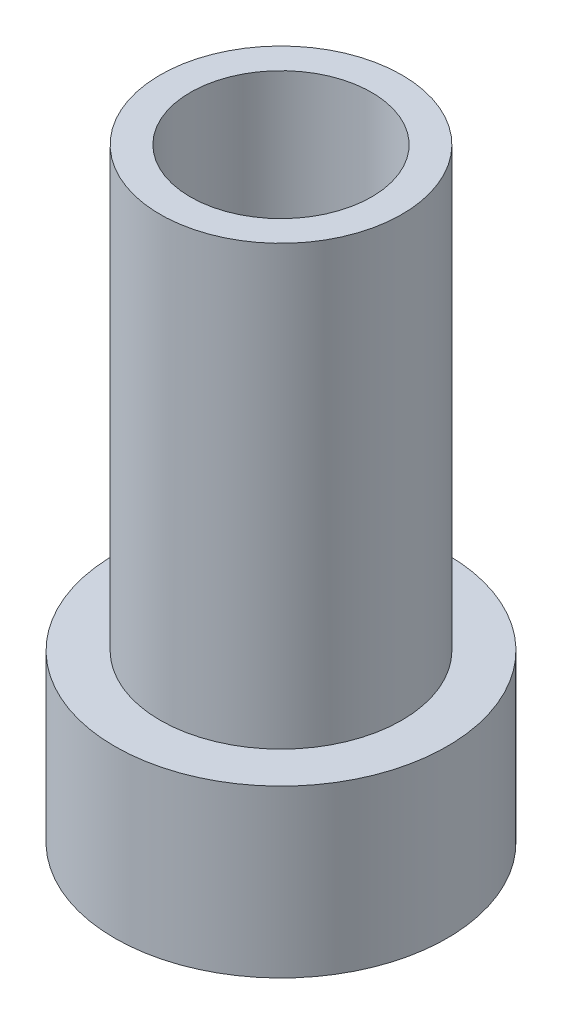
ISO-10303-21;
HEADER;
FILE_DESCRIPTION(('STEP AP214'),'2;1');
FILE_NAME('part.step','',(''),(''),'','','');
FILE_SCHEMA(('AUTOMOTIVE_DESIGN { 1 0 10303 214 1 1 1 1 }'));
ENDSEC;
DATA;
#1=APPLICATION_CONTEXT('core data for automotive mechanical design processes');
#2=APPLICATION_PROTOCOL_DEFINITION('international standard','automotive_design',2000,#1);
#3=PRODUCT_CONTEXT('',#1,'mechanical');
#4=PRODUCT('Part','Part','',(#3));
#5=PRODUCT_RELATED_PRODUCT_CATEGORY('part','',(#4));
#6=PRODUCT_DEFINITION_FORMATION('','',#4);
#7=PRODUCT_DEFINITION_CONTEXT('part definition',#1,'design');
#8=PRODUCT_DEFINITION('design','',#6,#7);
#9=PRODUCT_DEFINITION_SHAPE('','',#8);
#10=(LENGTH_UNIT() NAMED_UNIT(*) SI_UNIT(.MILLI.,.METRE.));
#11=(NAMED_UNIT(*) PLANE_ANGLE_UNIT() SI_UNIT($,.RADIAN.));
#12=(NAMED_UNIT(*) SI_UNIT($,.STERADIAN.) SOLID_ANGLE_UNIT());
#13=UNCERTAINTY_MEASURE_WITH_UNIT(LENGTH_MEASURE(1.E-05),#10,'distance_accuracy_value','');
#14=(GEOMETRIC_REPRESENTATION_CONTEXT(3) GLOBAL_UNCERTAINTY_ASSIGNED_CONTEXT((#13)) GLOBAL_UNIT_ASSIGNED_CONTEXT((#10,
#11,#12)) REPRESENTATION_CONTEXT('',''));
#15=CARTESIAN_POINT('',(0.,0.,0.));
#16=DIRECTION('',(0.,0.,1.));
#17=DIRECTION('',(1.,0.,0.));
#18=AXIS2_PLACEMENT_3D('',#15,#16,#17);
#19=CARTESIAN_POINT('',(0.,0.,0.));
#20=DIRECTION('',(0.,-1.,0.));
#21=DIRECTION('',(0.,0.,-1.));
#22=AXIS2_PLACEMENT_3D('',#19,#20,#21);
#23=CYLINDRICAL_SURFACE('',#22,5.5);
#24=CARTESIAN_POINT('',(0.,0.,0.));
#25=DIRECTION('',(0.,-1.,0.));
#26=DIRECTION('',(0.,0.,-1.));
#27=AXIS2_PLACEMENT_3D('',#24,#25,#26);
#28=CIRCLE('',#27,5.5);
#29=CARTESIAN_POINT('',(0.,0.,-5.5));
#30=VERTEX_POINT('',#29);
#31=EDGE_CURVE('E10',#30,#30,#28,.T.);
#32=ORIENTED_EDGE('',*,*,#31,.F.);
#33=EDGE_LOOP('',(#32));
#34=FACE_BOUND('',#33,.T.);
#35=CARTESIAN_POINT('',(0.,5.5,0.));
#36=DIRECTION('',(0.,1.,0.));
#37=DIRECTION('',(0.,0.,1.));
#38=AXIS2_PLACEMENT_3D('',#35,#36,#37);
#39=CIRCLE('',#38,5.5);
#40=CARTESIAN_POINT('',(0.,5.5,5.5));
#41=VERTEX_POINT('',#40);
#42=EDGE_CURVE('E57',#41,#41,#39,.T.);
#43=ORIENTED_EDGE('',*,*,#42,.F.);
#44=EDGE_LOOP('',(#43));
#45=FACE_BOUND('',#44,.T.);
#46=ADVANCED_FACE('F34',(#34,#45),#23,.T.);
#47=CARTESIAN_POINT('',(5.5,0.,0.));
#48=DIRECTION('',(0.,-1.,0.));
#49=DIRECTION('',(0.,0.,-1.));
#50=AXIS2_PLACEMENT_3D('',#47,#48,#49);
#51=PLANE('',#50);
#52=CARTESIAN_POINT('',(0.,0.,0.));
#53=DIRECTION('',(0.,-1.,0.));
#54=DIRECTION('',(0.,0.,-1.));
#55=AXIS2_PLACEMENT_3D('',#52,#53,#54);
#56=CIRCLE('',#55,2.);
#57=CARTESIAN_POINT('',(0.,0.,-2.));
#58=VERTEX_POINT('',#57);
#59=EDGE_CURVE('E54',#58,#58,#56,.T.);
#60=ORIENTED_EDGE('',*,*,#59,.F.);
#61=EDGE_LOOP('',(#60));
#62=FACE_BOUND('',#61,.T.);
#63=ORIENTED_EDGE('',*,*,#31,.T.);
#64=EDGE_LOOP('',(#63));
#65=FACE_BOUND('',#64,.T.);
#66=ADVANCED_FACE('F36',(#62,#65),#51,.T.);
#67=CARTESIAN_POINT('',(0.,0.,0.));
#68=DIRECTION('',(0.,-1.,0.));
#69=DIRECTION('',(0.,0.,-1.));
#70=AXIS2_PLACEMENT_3D('',#67,#68,#69);
#71=CYLINDRICAL_SURFACE('',#70,4.);
#72=CARTESIAN_POINT('',(0.,20.,0.));
#73=DIRECTION('',(0.,-1.,0.));
#74=DIRECTION('',(0.,0.,-1.));
#75=AXIS2_PLACEMENT_3D('',#72,#73,#74);
#76=CIRCLE('',#75,4.);
#77=CARTESIAN_POINT('',(0.,20.,-4.));
#78=VERTEX_POINT('',#77);
#79=EDGE_CURVE('E42',#78,#78,#76,.T.);
#80=ORIENTED_EDGE('',*,*,#79,.T.);
#81=EDGE_LOOP('',(#80));
#82=FACE_BOUND('',#81,.T.);
#83=CARTESIAN_POINT('',(0.,5.5,0.));
#84=DIRECTION('',(0.,1.,0.));
#85=DIRECTION('',(0.,0.,1.));
#86=AXIS2_PLACEMENT_3D('',#83,#84,#85);
#87=CIRCLE('',#86,4.);
#88=CARTESIAN_POINT('',(0.,5.5,4.));
#89=VERTEX_POINT('',#88);
#90=EDGE_CURVE('E60',#89,#89,#87,.T.);
#91=ORIENTED_EDGE('',*,*,#90,.T.);
#92=EDGE_LOOP('',(#91));
#93=FACE_BOUND('',#92,.T.);
#94=ADVANCED_FACE('F64',(#82,#93),#71,.T.);
#95=CARTESIAN_POINT('',(4.,20.,0.));
#96=DIRECTION('',(0.,1.,0.));
#97=DIRECTION('',(0.,0.,1.));
#98=AXIS2_PLACEMENT_3D('',#95,#96,#97);
#99=PLANE('',#98);
#100=CARTESIAN_POINT('',(0.,20.,0.));
#101=DIRECTION('',(0.,1.,0.));
#102=DIRECTION('',(0.,0.,1.));
#103=AXIS2_PLACEMENT_3D('',#100,#101,#102);
#104=CIRCLE('',#103,3.);
#105=CARTESIAN_POINT('',(0.,20.,3.));
#106=VERTEX_POINT('',#105);
#107=EDGE_CURVE('E49',#106,#106,#104,.T.);
#108=ORIENTED_EDGE('',*,*,#107,.F.);
#109=EDGE_LOOP('',(#108));
#110=FACE_BOUND('',#109,.T.);
#111=ORIENTED_EDGE('',*,*,#79,.F.);
#112=EDGE_LOOP('',(#111));
#113=FACE_BOUND('',#112,.T.);
#114=ADVANCED_FACE('F82',(#110,#113),#99,.T.);
#115=CARTESIAN_POINT('',(0.,10.,0.));
#116=DIRECTION('',(0.,1.,0.));
#117=DIRECTION('',(0.,0.,1.));
#118=AXIS2_PLACEMENT_3D('',#115,#116,#117);
#119=CYLINDRICAL_SURFACE('',#118,3.);
#120=CARTESIAN_POINT('',(0.,10.,0.));
#121=DIRECTION('',(0.,1.,0.));
#122=DIRECTION('',(0.,0.,1.));
#123=AXIS2_PLACEMENT_3D('',#120,#121,#122);
#124=CIRCLE('',#123,3.);
#125=CARTESIAN_POINT('',(0.,10.,3.));
#126=VERTEX_POINT('',#125);
#127=EDGE_CURVE('E46',#126,#126,#124,.T.);
#128=ORIENTED_EDGE('',*,*,#127,.F.);
#129=EDGE_LOOP('',(#128));
#130=FACE_BOUND('',#129,.T.);
#131=ORIENTED_EDGE('',*,*,#107,.T.);
#132=EDGE_LOOP('',(#131));
#133=FACE_BOUND('',#132,.T.);
#134=ADVANCED_FACE('F86',(#130,#133),#119,.F.);
#135=CARTESIAN_POINT('',(0.,10.,0.));
#136=DIRECTION('',(0.,1.,0.));
#137=DIRECTION('',(0.,0.,1.));
#138=AXIS2_PLACEMENT_3D('',#135,#136,#137);
#139=PLANE('',#138);
#140=CARTESIAN_POINT('',(0.,10.,0.));
#141=DIRECTION('',(0.,1.,0.));
#142=DIRECTION('',(0.,0.,1.));
#143=AXIS2_PLACEMENT_3D('',#140,#141,#142);
#144=CIRCLE('',#143,2.);
#145=CARTESIAN_POINT('',(0.,10.,2.));
#146=VERTEX_POINT('',#145);
#147=EDGE_CURVE('E38',#146,#146,#144,.T.);
#148=ORIENTED_EDGE('',*,*,#147,.F.);
#149=EDGE_LOOP('',(#148));
#150=FACE_BOUND('',#149,.T.);
#151=ORIENTED_EDGE('',*,*,#127,.T.);
#152=EDGE_LOOP('',(#151));
#153=FACE_BOUND('',#152,.T.);
#154=ADVANCED_FACE('F90',(#150,#153),#139,.T.);
#155=CARTESIAN_POINT('',(0.,20.,0.));
#156=DIRECTION('',(0.,-1.,0.));
#157=DIRECTION('',(0.,0.,-1.));
#158=AXIS2_PLACEMENT_3D('',#155,#156,#157);
#159=CYLINDRICAL_SURFACE('',#158,2.);
#160=ORIENTED_EDGE('',*,*,#147,.T.);
#161=EDGE_LOOP('',(#160));
#162=FACE_BOUND('',#161,.T.);
#163=ORIENTED_EDGE('',*,*,#59,.T.);
#164=EDGE_LOOP('',(#163));
#165=FACE_BOUND('',#164,.T.);
#166=ADVANCED_FACE('F69',(#162,#165),#159,.F.);
#167=CARTESIAN_POINT('',(0.,5.5,0.));
#168=DIRECTION('',(0.,1.,0.));
#169=DIRECTION('',(0.,0.,1.));
#170=AXIS2_PLACEMENT_3D('',#167,#168,#169);
#171=PLANE('',#170);
#172=ORIENTED_EDGE('',*,*,#90,.F.);
#173=EDGE_LOOP('',(#172));
#174=FACE_BOUND('',#173,.T.);
#175=ORIENTED_EDGE('',*,*,#42,.T.);
#176=EDGE_LOOP('',(#175));
#177=FACE_BOUND('',#176,.T.);
#178=ADVANCED_FACE('F66',(#174,#177),#171,.T.);
#179=CLOSED_SHELL('',(#46,#66,#94,#114,#134,#154,#166,#178));
#180=MANIFOLD_SOLID_BREP('B2',#179);
#181=ADVANCED_BREP_SHAPE_REPRESENTATION('',(#18,#180),#14);
#182=SHAPE_DEFINITION_REPRESENTATION(#9,#181);
ENDSEC;
END-ISO-10303-21;
